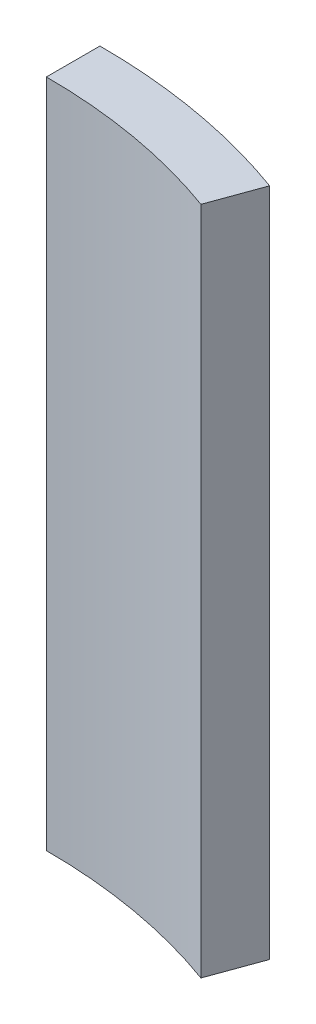
ISO-10303-21;
HEADER;
FILE_DESCRIPTION(('STEP AP214'),'2;1');
FILE_NAME('part.step','',(''),(''),'','','');
FILE_SCHEMA(('AUTOMOTIVE_DESIGN { 1 0 10303 214 1 1 1 1 }'));
ENDSEC;
DATA;
#1=APPLICATION_CONTEXT('core data for automotive mechanical design processes');
#2=APPLICATION_PROTOCOL_DEFINITION('international standard','automotive_design',2000,#1);
#3=PRODUCT_CONTEXT('',#1,'mechanical');
#4=PRODUCT('Part','Part','',(#3));
#5=PRODUCT_RELATED_PRODUCT_CATEGORY('part','',(#4));
#6=PRODUCT_DEFINITION_FORMATION('','',#4);
#7=PRODUCT_DEFINITION_CONTEXT('part definition',#1,'design');
#8=PRODUCT_DEFINITION('design','',#6,#7);
#9=PRODUCT_DEFINITION_SHAPE('','',#8);
#10=(LENGTH_UNIT() NAMED_UNIT(*) SI_UNIT(.MILLI.,.METRE.));
#11=(NAMED_UNIT(*) PLANE_ANGLE_UNIT() SI_UNIT($,.RADIAN.));
#12=(NAMED_UNIT(*) SI_UNIT($,.STERADIAN.) SOLID_ANGLE_UNIT());
#13=UNCERTAINTY_MEASURE_WITH_UNIT(LENGTH_MEASURE(1.E-05),#10,'distance_accuracy_value','');
#14=(GEOMETRIC_REPRESENTATION_CONTEXT(3) GLOBAL_UNCERTAINTY_ASSIGNED_CONTEXT((#13)) GLOBAL_UNIT_ASSIGNED_CONTEXT((#10,
#11,#12)) REPRESENTATION_CONTEXT('',''));
#15=CARTESIAN_POINT('',(0.,0.,0.));
#16=DIRECTION('',(0.,0.,1.));
#17=DIRECTION('',(1.,0.,0.));
#18=AXIS2_PLACEMENT_3D('',#15,#16,#17);
#19=CARTESIAN_POINT('',(0.,25.,0.));
#20=DIRECTION('',(0.,-1.,0.));
#21=DIRECTION('',(0.,0.,-1.));
#22=AXIS2_PLACEMENT_3D('',#19,#20,#21);
#23=CYLINDRICAL_SURFACE('',#22,22.5);
#24=CARTESIAN_POINT('',(0.,0.,0.));
#25=DIRECTION('',(0.,1.,0.));
#26=DIRECTION('',(0.,0.,-1.));
#27=AXIS2_PLACEMENT_3D('',#24,#25,#26);
#28=CIRCLE('',#27,22.5);
#29=CARTESIAN_POINT('',(7.68292682926829,0.,-21.1476390014609));
#30=VERTEX_POINT('',#29);
#31=CARTESIAN_POINT('',(0.,0.,-22.5));
#32=VERTEX_POINT('',#31);
#33=EDGE_CURVE('E97',#30,#32,#28,.T.);
#34=ORIENTED_EDGE('',*,*,#33,.T.);
#35=DIRECTION('',(0.,-1.,0.));
#36=VECTOR('',#35,1.);
#37=CARTESIAN_POINT('',(0.,25.,-22.5));
#38=LINE('',#37,#36);
#39=CARTESIAN_POINT('',(0.,25.,-22.5));
#40=VERTEX_POINT('',#39);
#41=EDGE_CURVE('E11',#40,#32,#38,.T.);
#42=ORIENTED_EDGE('',*,*,#41,.F.);
#43=CARTESIAN_POINT('',(0.,25.,0.));
#44=DIRECTION('',(0.,1.,0.));
#45=DIRECTION('',(0.,0.,-1.));
#46=AXIS2_PLACEMENT_3D('',#43,#44,#45);
#47=CIRCLE('',#46,22.5);
#48=CARTESIAN_POINT('',(7.68292682926829,25.,-21.1476390014609));
#49=VERTEX_POINT('',#48);
#50=EDGE_CURVE('E85',#49,#40,#47,.T.);
#51=ORIENTED_EDGE('',*,*,#50,.F.);
#52=DIRECTION('',(0.,-1.,0.));
#53=VECTOR('',#52,1.);
#54=CARTESIAN_POINT('',(7.68292682926829,25.,-21.1476390014609));
#55=LINE('',#54,#53);
#56=EDGE_CURVE('E93',#49,#30,#55,.T.);
#57=ORIENTED_EDGE('',*,*,#56,.T.);
#58=EDGE_LOOP('',(#34,#42,#51,#57));
#59=FACE_BOUND('',#58,.T.);
#60=ADVANCED_FACE('F34',(#59),#23,.T.);
#61=CARTESIAN_POINT('',(0.,25.,-20.5));
#62=DIRECTION('',(1.,0.,0.));
#63=DIRECTION('',(0.,0.,-1.));
#64=AXIS2_PLACEMENT_3D('',#61,#62,#63);
#65=PLANE('',#64);
#66=DIRECTION('',(0.,0.,1.));
#67=VECTOR('',#66,1.);
#68=CARTESIAN_POINT('',(0.,0.,-20.5));
#69=LINE('',#68,#67);
#70=CARTESIAN_POINT('',(0.,0.,-20.5));
#71=VERTEX_POINT('',#70);
#72=EDGE_CURVE('E89',#32,#71,#69,.T.);
#73=ORIENTED_EDGE('',*,*,#72,.T.);
#74=DIRECTION('',(0.,-1.,0.));
#75=VECTOR('',#74,1.);
#76=CARTESIAN_POINT('',(0.,25.,-20.5));
#77=LINE('',#76,#75);
#78=CARTESIAN_POINT('',(0.,25.,-20.5));
#79=VERTEX_POINT('',#78);
#80=EDGE_CURVE('E42',#79,#71,#77,.T.);
#81=ORIENTED_EDGE('',*,*,#80,.F.);
#82=DIRECTION('',(0.,0.,1.));
#83=VECTOR('',#82,1.);
#84=CARTESIAN_POINT('',(0.,25.,-20.5));
#85=LINE('',#84,#83);
#86=EDGE_CURVE('E80',#40,#79,#85,.T.);
#87=ORIENTED_EDGE('',*,*,#86,.F.);
#88=ORIENTED_EDGE('',*,*,#41,.T.);
#89=EDGE_LOOP('',(#73,#81,#87,#88));
#90=FACE_BOUND('',#89,.T.);
#91=ADVANCED_FACE('F88',(#90),#65,.F.);
#92=CARTESIAN_POINT('',(0.,25.,0.));
#93=DIRECTION('',(0.,-1.,0.));
#94=DIRECTION('',(0.,0.,-1.));
#95=AXIS2_PLACEMENT_3D('',#92,#93,#94);
#96=CYLINDRICAL_SURFACE('',#95,20.5);
#97=CARTESIAN_POINT('',(0.,0.,0.));
#98=DIRECTION('',(0.,-1.,0.));
#99=DIRECTION('',(0.,0.,-1.));
#100=AXIS2_PLACEMENT_3D('',#97,#98,#99);
#101=CIRCLE('',#100,20.5);
#102=CARTESIAN_POINT('',(7.,0.,-19.2678488679977));
#103=VERTEX_POINT('',#102);
#104=EDGE_CURVE('E67',#71,#103,#101,.T.);
#105=ORIENTED_EDGE('',*,*,#104,.T.);
#106=DIRECTION('',(0.,-1.,0.));
#107=VECTOR('',#106,1.);
#108=CARTESIAN_POINT('',(7.,25.,-19.2678488679977));
#109=LINE('',#108,#107);
#110=CARTESIAN_POINT('',(7.,25.,-19.2678488679977));
#111=VERTEX_POINT('',#110);
#112=EDGE_CURVE('E90',#111,#103,#109,.T.);
#113=ORIENTED_EDGE('',*,*,#112,.F.);
#114=CARTESIAN_POINT('',(0.,25.,0.));
#115=DIRECTION('',(0.,-1.,0.));
#116=DIRECTION('',(0.,0.,-1.));
#117=AXIS2_PLACEMENT_3D('',#114,#115,#116);
#118=CIRCLE('',#117,20.5);
#119=EDGE_CURVE('E83',#79,#111,#118,.T.);
#120=ORIENTED_EDGE('',*,*,#119,.F.);
#121=ORIENTED_EDGE('',*,*,#80,.T.);
#122=EDGE_LOOP('',(#105,#113,#120,#121));
#123=FACE_BOUND('',#122,.T.);
#124=ADVANCED_FACE('F91',(#123),#96,.F.);
#125=CARTESIAN_POINT('',(7.,25.,-19.2678488679977));
#126=DIRECTION('',(-0.939895066731595,0.,-0.341463414634146));
#127=DIRECTION('',(-0.341463414634146,0.,0.939895066731595));
#128=AXIS2_PLACEMENT_3D('',#125,#126,#127);
#129=PLANE('',#128);
#130=DIRECTION('',(0.341463414634146,0.,-0.939895066731595));
#131=VECTOR('',#130,1.);
#132=CARTESIAN_POINT('',(7.,0.,-19.2678488679977));
#133=LINE('',#132,#131);
#134=EDGE_CURVE('E73',#103,#30,#133,.T.);
#135=ORIENTED_EDGE('',*,*,#134,.T.);
#136=ORIENTED_EDGE('',*,*,#56,.F.);
#137=DIRECTION('',(0.341463414634146,0.,-0.939895066731595));
#138=VECTOR('',#137,1.);
#139=CARTESIAN_POINT('',(7.,25.,-19.2678488679977));
#140=LINE('',#139,#138);
#141=EDGE_CURVE('E50',#111,#49,#140,.T.);
#142=ORIENTED_EDGE('',*,*,#141,.F.);
#143=ORIENTED_EDGE('',*,*,#112,.T.);
#144=EDGE_LOOP('',(#135,#136,#142,#143));
#145=FACE_BOUND('',#144,.T.);
#146=ADVANCED_FACE('F104',(#145),#129,.F.);
#147=CARTESIAN_POINT('',(0.,25.,0.));
#148=DIRECTION('',(0.,-1.,0.));
#149=DIRECTION('',(0.,0.,-1.));
#150=AXIS2_PLACEMENT_3D('',#147,#148,#149);
#151=PLANE('',#150);
#152=ORIENTED_EDGE('',*,*,#50,.T.);
#153=ORIENTED_EDGE('',*,*,#86,.T.);
#154=ORIENTED_EDGE('',*,*,#119,.T.);
#155=ORIENTED_EDGE('',*,*,#141,.T.);
#156=EDGE_LOOP('',(#152,#153,#154,#155));
#157=FACE_BOUND('',#156,.T.);
#158=ADVANCED_FACE('F81',(#157),#151,.F.);
#159=CARTESIAN_POINT('',(0.,0.,0.));
#160=DIRECTION('',(0.,-1.,0.));
#161=DIRECTION('',(0.,0.,-1.));
#162=AXIS2_PLACEMENT_3D('',#159,#160,#161);
#163=PLANE('',#162);
#164=ORIENTED_EDGE('',*,*,#33,.F.);
#165=ORIENTED_EDGE('',*,*,#134,.F.);
#166=ORIENTED_EDGE('',*,*,#104,.F.);
#167=ORIENTED_EDGE('',*,*,#72,.F.);
#168=EDGE_LOOP('',(#164,#165,#166,#167));
#169=FACE_BOUND('',#168,.T.);
#170=ADVANCED_FACE('F107',(#169),#163,.T.);
#171=CLOSED_SHELL('',(#60,#91,#124,#146,#158,#170));
#172=MANIFOLD_SOLID_BREP('B2',#171);
#173=ADVANCED_BREP_SHAPE_REPRESENTATION('',(#18,#172),#14);
#174=SHAPE_DEFINITION_REPRESENTATION(#9,#173);
ENDSEC;
END-ISO-10303-21;
